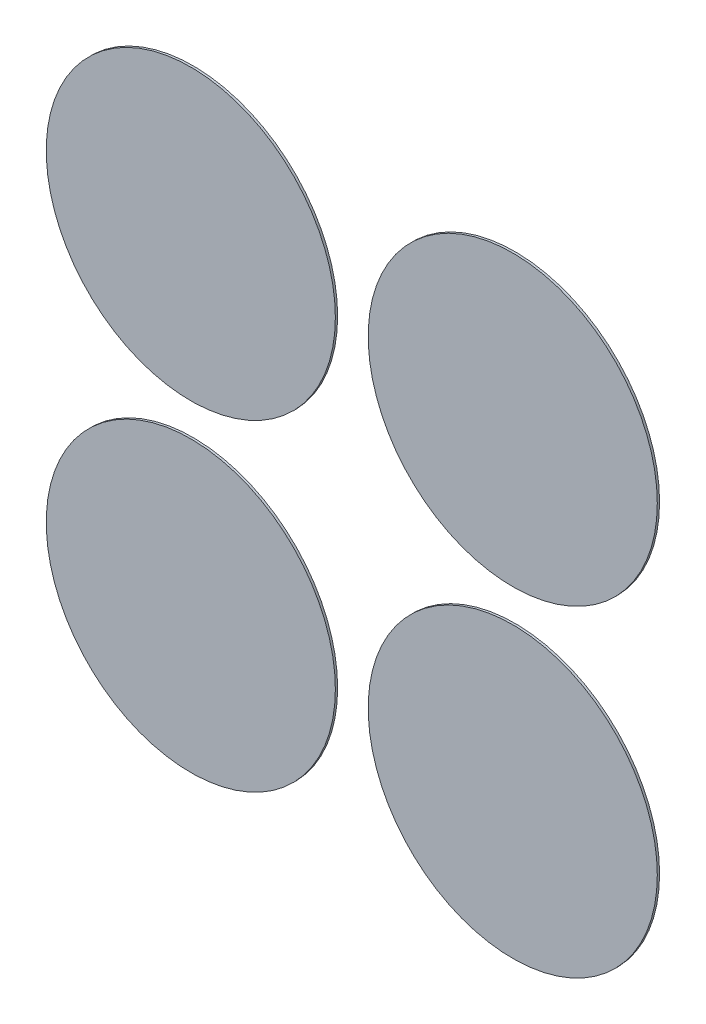
ISO-10303-21;
HEADER;
FILE_DESCRIPTION(('STEP AP214'),'2;1');
FILE_NAME('part.step','',(''),(''),'','','');
FILE_SCHEMA(('AUTOMOTIVE_DESIGN { 1 0 10303 214 1 1 1 1 }'));
ENDSEC;
DATA;
#1=APPLICATION_CONTEXT('core data for automotive mechanical design processes');
#2=APPLICATION_PROTOCOL_DEFINITION('international standard','automotive_design',2000,#1);
#3=PRODUCT_CONTEXT('',#1,'mechanical');
#4=PRODUCT('Part','Part','',(#3));
#5=PRODUCT_RELATED_PRODUCT_CATEGORY('part','',(#4));
#6=PRODUCT_DEFINITION_FORMATION('','',#4);
#7=PRODUCT_DEFINITION_CONTEXT('part definition',#1,'design');
#8=PRODUCT_DEFINITION('design','',#6,#7);
#9=PRODUCT_DEFINITION_SHAPE('','',#8);
#10=(LENGTH_UNIT() NAMED_UNIT(*) SI_UNIT(.MILLI.,.METRE.));
#11=(NAMED_UNIT(*) PLANE_ANGLE_UNIT() SI_UNIT($,.RADIAN.));
#12=(NAMED_UNIT(*) SI_UNIT($,.STERADIAN.) SOLID_ANGLE_UNIT());
#13=UNCERTAINTY_MEASURE_WITH_UNIT(LENGTH_MEASURE(1.E-05),#10,'distance_accuracy_value','');
#14=(GEOMETRIC_REPRESENTATION_CONTEXT(3) GLOBAL_UNCERTAINTY_ASSIGNED_CONTEXT((#13)) GLOBAL_UNIT_ASSIGNED_CONTEXT((#10,
#11,#12)) REPRESENTATION_CONTEXT('',''));
#15=CARTESIAN_POINT('',(0.,0.,0.));
#16=DIRECTION('',(0.,0.,1.));
#17=DIRECTION('',(1.,0.,0.));
#18=AXIS2_PLACEMENT_3D('',#15,#16,#17);
#19=CARTESIAN_POINT('',(-150.160541828201,-83.0050648215693,0.1));
#20=DIRECTION('',(0.,0.,-1.));
#21=DIRECTION('',(-1.,0.,0.));
#22=AXIS2_PLACEMENT_3D('',#19,#20,#21);
#23=CYLINDRICAL_SURFACE('',#22,6.34999999999999);
#24=CARTESIAN_POINT('',(-150.160541828201,-83.0050648215693,0.1));
#25=DIRECTION('',(0.,0.,1.));
#26=DIRECTION('',(1.,0.,0.));
#27=AXIS2_PLACEMENT_3D('',#24,#25,#26);
#28=CIRCLE('',#27,6.34999999999999);
#29=CARTESIAN_POINT('',(-143.810541828201,-83.0050648215693,0.1));
#30=VERTEX_POINT('',#29);
#31=EDGE_CURVE('E48',#30,#30,#28,.T.);
#32=ORIENTED_EDGE('',*,*,#31,.F.);
#33=EDGE_LOOP('',(#32));
#34=FACE_BOUND('',#33,.T.);
#35=CARTESIAN_POINT('',(-150.160541828201,-83.0050648215693,0.));
#36=DIRECTION('',(0.,0.,1.));
#37=DIRECTION('',(1.,0.,0.));
#38=AXIS2_PLACEMENT_3D('',#35,#36,#37);
#39=CIRCLE('',#38,6.34999999999999);
#40=CARTESIAN_POINT('',(-143.810541828201,-83.0050648215693,0.));
#41=VERTEX_POINT('',#40);
#42=EDGE_CURVE('E11',#41,#41,#39,.T.);
#43=ORIENTED_EDGE('',*,*,#42,.T.);
#44=EDGE_LOOP('',(#43));
#45=FACE_BOUND('',#44,.T.);
#46=ADVANCED_FACE('F44',(#34,#45),#23,.T.);
#47=CARTESIAN_POINT('',(-150.160541828201,-83.0050648215693,0.1));
#48=DIRECTION('',(0.,0.,1.));
#49=DIRECTION('',(1.,0.,0.));
#50=AXIS2_PLACEMENT_3D('',#47,#48,#49);
#51=PLANE('',#50);
#52=ORIENTED_EDGE('',*,*,#31,.T.);
#53=EDGE_LOOP('',(#52));
#54=FACE_BOUND('',#53,.T.);
#55=ADVANCED_FACE('F46',(#54),#51,.T.);
#56=CARTESIAN_POINT('',(-150.160541828201,-83.0050648215693,0.));
#57=DIRECTION('',(0.,0.,1.));
#58=DIRECTION('',(1.,0.,0.));
#59=AXIS2_PLACEMENT_3D('',#56,#57,#58);
#60=PLANE('',#59);
#61=ORIENTED_EDGE('',*,*,#42,.F.);
#62=EDGE_LOOP('',(#61));
#63=FACE_BOUND('',#62,.T.);
#64=ADVANCED_FACE('F65',(#63),#60,.F.);
#65=CLOSED_SHELL('',(#46,#55,#64));
#66=MANIFOLD_SOLID_BREP('B2',#65);
#67=CARTESIAN_POINT('',(-150.160541828201,-97.1472004453003,0.1));
#68=DIRECTION('',(0.,0.,-1.));
#69=DIRECTION('',(-1.,0.,0.));
#70=AXIS2_PLACEMENT_3D('',#67,#68,#69);
#71=CYLINDRICAL_SURFACE('',#70,6.34999999999999);
#72=CARTESIAN_POINT('',(-150.160541828201,-97.1472004453003,0.1));
#73=DIRECTION('',(0.,0.,1.));
#74=DIRECTION('',(1.,0.,0.));
#75=AXIS2_PLACEMENT_3D('',#72,#73,#74);
#76=CIRCLE('',#75,6.34999999999999);
#77=CARTESIAN_POINT('',(-143.810541828201,-97.1472004453003,0.1));
#78=VERTEX_POINT('',#77);
#79=EDGE_CURVE('E99',#78,#78,#76,.T.);
#80=ORIENTED_EDGE('',*,*,#79,.F.);
#81=EDGE_LOOP('',(#80));
#82=FACE_BOUND('',#81,.T.);
#83=CARTESIAN_POINT('',(-150.160541828201,-97.1472004453003,0.));
#84=DIRECTION('',(0.,0.,1.));
#85=DIRECTION('',(1.,0.,0.));
#86=AXIS2_PLACEMENT_3D('',#83,#84,#85);
#87=CIRCLE('',#86,6.34999999999999);
#88=CARTESIAN_POINT('',(-143.810541828201,-97.1472004453003,0.));
#89=VERTEX_POINT('',#88);
#90=EDGE_CURVE('E43',#89,#89,#87,.T.);
#91=ORIENTED_EDGE('',*,*,#90,.T.);
#92=EDGE_LOOP('',(#91));
#93=FACE_BOUND('',#92,.T.);
#94=ADVANCED_FACE('F95',(#82,#93),#71,.T.);
#95=CARTESIAN_POINT('',(-150.160541828201,-97.1472004453003,0.1));
#96=DIRECTION('',(0.,0.,1.));
#97=DIRECTION('',(1.,0.,0.));
#98=AXIS2_PLACEMENT_3D('',#95,#96,#97);
#99=PLANE('',#98);
#100=ORIENTED_EDGE('',*,*,#79,.T.);
#101=EDGE_LOOP('',(#100));
#102=FACE_BOUND('',#101,.T.);
#103=ADVANCED_FACE('F97',(#102),#99,.T.);
#104=CARTESIAN_POINT('',(-150.160541828201,-97.1472004453003,0.));
#105=DIRECTION('',(0.,0.,1.));
#106=DIRECTION('',(1.,0.,0.));
#107=AXIS2_PLACEMENT_3D('',#104,#105,#106);
#108=PLANE('',#107);
#109=ORIENTED_EDGE('',*,*,#90,.F.);
#110=EDGE_LOOP('',(#109));
#111=FACE_BOUND('',#110,.T.);
#112=ADVANCED_FACE('F116',(#111),#108,.F.);
#113=CLOSED_SHELL('',(#94,#103,#112));
#114=MANIFOLD_SOLID_BREP('B6',#113);
#115=CARTESIAN_POINT('',(-136.01840620447,-97.1472004453001,0.1));
#116=DIRECTION('',(0.,0.,-1.));
#117=DIRECTION('',(-1.,0.,0.));
#118=AXIS2_PLACEMENT_3D('',#115,#116,#117);
#119=CYLINDRICAL_SURFACE('',#118,6.34999999999999);
#120=CARTESIAN_POINT('',(-136.01840620447,-97.1472004453001,0.1));
#121=DIRECTION('',(0.,0.,1.));
#122=DIRECTION('',(1.,0.,0.));
#123=AXIS2_PLACEMENT_3D('',#120,#121,#122);
#124=CIRCLE('',#123,6.34999999999999);
#125=CARTESIAN_POINT('',(-129.66840620447,-97.1472004453001,0.1));
#126=VERTEX_POINT('',#125);
#127=EDGE_CURVE('E151',#126,#126,#124,.T.);
#128=ORIENTED_EDGE('',*,*,#127,.F.);
#129=EDGE_LOOP('',(#128));
#130=FACE_BOUND('',#129,.T.);
#131=CARTESIAN_POINT('',(-136.01840620447,-97.1472004453001,0.));
#132=DIRECTION('',(0.,0.,1.));
#133=DIRECTION('',(1.,0.,0.));
#134=AXIS2_PLACEMENT_3D('',#131,#132,#133);
#135=CIRCLE('',#134,6.34999999999999);
#136=CARTESIAN_POINT('',(-129.66840620447,-97.1472004453001,0.));
#137=VERTEX_POINT('',#136);
#138=EDGE_CURVE('E94',#137,#137,#135,.T.);
#139=ORIENTED_EDGE('',*,*,#138,.T.);
#140=EDGE_LOOP('',(#139));
#141=FACE_BOUND('',#140,.T.);
#142=ADVANCED_FACE('F147',(#130,#141),#119,.T.);
#143=CARTESIAN_POINT('',(-136.01840620447,-97.1472004453001,0.1));
#144=DIRECTION('',(0.,0.,1.));
#145=DIRECTION('',(1.,0.,0.));
#146=AXIS2_PLACEMENT_3D('',#143,#144,#145);
#147=PLANE('',#146);
#148=ORIENTED_EDGE('',*,*,#127,.T.);
#149=EDGE_LOOP('',(#148));
#150=FACE_BOUND('',#149,.T.);
#151=ADVANCED_FACE('F149',(#150),#147,.T.);
#152=CARTESIAN_POINT('',(-136.01840620447,-97.1472004453001,0.));
#153=DIRECTION('',(0.,0.,1.));
#154=DIRECTION('',(1.,0.,0.));
#155=AXIS2_PLACEMENT_3D('',#152,#153,#154);
#156=PLANE('',#155);
#157=ORIENTED_EDGE('',*,*,#138,.F.);
#158=EDGE_LOOP('',(#157));
#159=FACE_BOUND('',#158,.T.);
#160=ADVANCED_FACE('F168',(#159),#156,.F.);
#161=CLOSED_SHELL('',(#142,#151,#160));
#162=MANIFOLD_SOLID_BREP('B38',#161);
#163=CARTESIAN_POINT('',(-136.01840620447,-83.0050648215692,0.1));
#164=DIRECTION('',(0.,0.,-1.));
#165=DIRECTION('',(-1.,0.,0.));
#166=AXIS2_PLACEMENT_3D('',#163,#164,#165);
#167=CYLINDRICAL_SURFACE('',#166,6.34999999999999);
#168=CARTESIAN_POINT('',(-136.01840620447,-83.0050648215692,0.1));
#169=DIRECTION('',(0.,0.,1.));
#170=DIRECTION('',(1.,0.,0.));
#171=AXIS2_PLACEMENT_3D('',#168,#169,#170);
#172=CIRCLE('',#171,6.34999999999999);
#173=CARTESIAN_POINT('',(-129.66840620447,-83.0050648215692,0.1));
#174=VERTEX_POINT('',#173);
#175=EDGE_CURVE('E146',#174,#174,#172,.T.);
#176=ORIENTED_EDGE('',*,*,#175,.F.);
#177=EDGE_LOOP('',(#176));
#178=FACE_BOUND('',#177,.T.);
#179=CARTESIAN_POINT('',(-136.01840620447,-83.0050648215692,0.));
#180=DIRECTION('',(0.,0.,1.));
#181=DIRECTION('',(1.,0.,0.));
#182=AXIS2_PLACEMENT_3D('',#179,#180,#181);
#183=CIRCLE('',#182,6.34999999999999);
#184=CARTESIAN_POINT('',(-129.66840620447,-83.0050648215692,0.));
#185=VERTEX_POINT('',#184);
#186=EDGE_CURVE('E195',#185,#185,#183,.T.);
#187=ORIENTED_EDGE('',*,*,#186,.T.);
#188=EDGE_LOOP('',(#187));
#189=FACE_BOUND('',#188,.T.);
#190=ADVANCED_FACE('F192',(#178,#189),#167,.T.);
#191=CARTESIAN_POINT('',(-136.01840620447,-83.0050648215692,0.1));
#192=DIRECTION('',(0.,0.,1.));
#193=DIRECTION('',(1.,0.,0.));
#194=AXIS2_PLACEMENT_3D('',#191,#192,#193);
#195=PLANE('',#194);
#196=ORIENTED_EDGE('',*,*,#175,.T.);
#197=EDGE_LOOP('',(#196));
#198=FACE_BOUND('',#197,.T.);
#199=ADVANCED_FACE('F209',(#198),#195,.T.);
#200=CARTESIAN_POINT('',(-136.01840620447,-83.0050648215692,0.));
#201=DIRECTION('',(0.,0.,1.));
#202=DIRECTION('',(1.,0.,0.));
#203=AXIS2_PLACEMENT_3D('',#200,#201,#202);
#204=PLANE('',#203);
#205=ORIENTED_EDGE('',*,*,#186,.F.);
#206=EDGE_LOOP('',(#205));
#207=FACE_BOUND('',#206,.T.);
#208=ADVANCED_FACE('F207',(#207),#204,.F.);
#209=CLOSED_SHELL('',(#190,#199,#208));
#210=MANIFOLD_SOLID_BREP('B89',#209);
#211=ADVANCED_BREP_SHAPE_REPRESENTATION('',(#18,#66,#114,#162,#210),#14);
#212=SHAPE_DEFINITION_REPRESENTATION(#9,#211);
ENDSEC;
END-ISO-10303-21;
